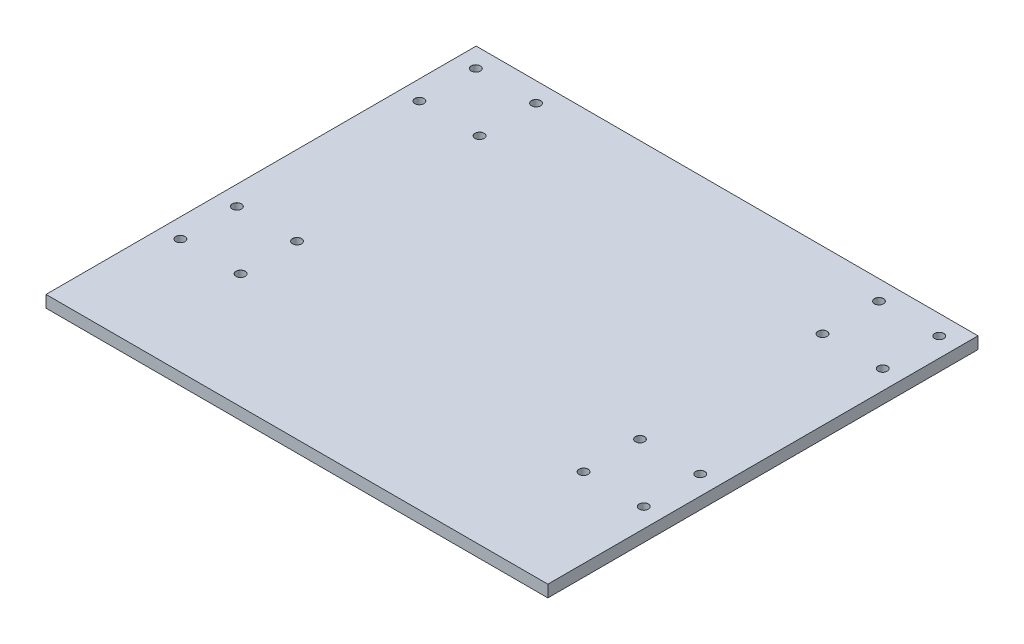
ISO-10303-21;
HEADER;
FILE_DESCRIPTION(('STEP AP214'),'2;1');
FILE_NAME('part.step','',(''),(''),'','','');
FILE_SCHEMA(('AUTOMOTIVE_DESIGN { 1 0 10303 214 1 1 1 1 }'));
ENDSEC;
DATA;
#1=APPLICATION_CONTEXT('core data for automotive mechanical design processes');
#2=APPLICATION_PROTOCOL_DEFINITION('international standard','automotive_design',2000,#1);
#3=PRODUCT_CONTEXT('',#1,'mechanical');
#4=PRODUCT('Part','Part','',(#3));
#5=PRODUCT_RELATED_PRODUCT_CATEGORY('part','',(#4));
#6=PRODUCT_DEFINITION_FORMATION('','',#4);
#7=PRODUCT_DEFINITION_CONTEXT('part definition',#1,'design');
#8=PRODUCT_DEFINITION('design','',#6,#7);
#9=PRODUCT_DEFINITION_SHAPE('','',#8);
#10=(LENGTH_UNIT() NAMED_UNIT(*) SI_UNIT(.MILLI.,.METRE.));
#11=(NAMED_UNIT(*) PLANE_ANGLE_UNIT() SI_UNIT($,.RADIAN.));
#12=(NAMED_UNIT(*) SI_UNIT($,.STERADIAN.) SOLID_ANGLE_UNIT());
#13=UNCERTAINTY_MEASURE_WITH_UNIT(LENGTH_MEASURE(1.E-05),#10,'distance_accuracy_value','');
#14=(GEOMETRIC_REPRESENTATION_CONTEXT(3) GLOBAL_UNCERTAINTY_ASSIGNED_CONTEXT((#13)) GLOBAL_UNIT_ASSIGNED_CONTEXT((#10,
#11,#12)) REPRESENTATION_CONTEXT('',''));
#15=CARTESIAN_POINT('',(0.,0.,0.));
#16=DIRECTION('',(0.,0.,1.));
#17=DIRECTION('',(1.,0.,0.));
#18=AXIS2_PLACEMENT_3D('',#15,#16,#17);
#19=CARTESIAN_POINT('',(133.35,6.35,-114.3));
#20=DIRECTION('',(-1.,0.,0.));
#21=DIRECTION('',(0.,0.,1.));
#22=AXIS2_PLACEMENT_3D('',#19,#20,#21);
#23=PLANE('',#22);
#24=DIRECTION('',(0.,0.,-1.));
#25=VECTOR('',#24,1.);
#26=CARTESIAN_POINT('',(133.35,0.,-114.3));
#27=LINE('',#26,#25);
#28=CARTESIAN_POINT('',(133.35,0.,114.3));
#29=VERTEX_POINT('',#28);
#30=CARTESIAN_POINT('',(133.35,0.,-114.3));
#31=VERTEX_POINT('',#30);
#32=EDGE_CURVE('E96',#29,#31,#27,.T.);
#33=ORIENTED_EDGE('',*,*,#32,.T.);
#34=DIRECTION('',(0.,-1.,0.));
#35=VECTOR('',#34,1.);
#36=CARTESIAN_POINT('',(133.35,6.35,-114.3));
#37=LINE('',#36,#35);
#38=CARTESIAN_POINT('',(133.35,6.35,-114.3));
#39=VERTEX_POINT('',#38);
#40=EDGE_CURVE('E11',#39,#31,#37,.T.);
#41=ORIENTED_EDGE('',*,*,#40,.F.);
#42=DIRECTION('',(0.,0.,-1.));
#43=VECTOR('',#42,1.);
#44=CARTESIAN_POINT('',(133.35,6.35,-114.3));
#45=LINE('',#44,#43);
#46=CARTESIAN_POINT('',(133.35,6.35,114.3));
#47=VERTEX_POINT('',#46);
#48=EDGE_CURVE('E84',#47,#39,#45,.T.);
#49=ORIENTED_EDGE('',*,*,#48,.F.);
#50=DIRECTION('',(0.,-1.,0.));
#51=VECTOR('',#50,1.);
#52=CARTESIAN_POINT('',(133.35,6.35,114.3));
#53=LINE('',#52,#51);
#54=EDGE_CURVE('E92',#47,#29,#53,.T.);
#55=ORIENTED_EDGE('',*,*,#54,.T.);
#56=EDGE_LOOP('',(#33,#41,#49,#55));
#57=FACE_BOUND('',#56,.T.);
#58=ADVANCED_FACE('F33',(#57),#23,.F.);
#59=CARTESIAN_POINT('',(-133.35,6.35,-114.3));
#60=DIRECTION('',(0.,0.,1.));
#61=DIRECTION('',(1.,0.,0.));
#62=AXIS2_PLACEMENT_3D('',#59,#60,#61);
#63=PLANE('',#62);
#64=DIRECTION('',(-1.,0.,0.));
#65=VECTOR('',#64,1.);
#66=CARTESIAN_POINT('',(-133.35,0.,-114.3));
#67=LINE('',#66,#65);
#68=CARTESIAN_POINT('',(-133.35,0.,-114.3));
#69=VERTEX_POINT('',#68);
#70=EDGE_CURVE('E88',#31,#69,#67,.T.);
#71=ORIENTED_EDGE('',*,*,#70,.T.);
#72=DIRECTION('',(0.,-1.,0.));
#73=VECTOR('',#72,1.);
#74=CARTESIAN_POINT('',(-133.35,6.35,-114.3));
#75=LINE('',#74,#73);
#76=CARTESIAN_POINT('',(-133.35,6.35,-114.3));
#77=VERTEX_POINT('',#76);
#78=EDGE_CURVE('E41',#77,#69,#75,.T.);
#79=ORIENTED_EDGE('',*,*,#78,.F.);
#80=DIRECTION('',(-1.,0.,0.));
#81=VECTOR('',#80,1.);
#82=CARTESIAN_POINT('',(-133.35,6.35,-114.3));
#83=LINE('',#82,#81);
#84=EDGE_CURVE('E79',#39,#77,#83,.T.);
#85=ORIENTED_EDGE('',*,*,#84,.F.);
#86=ORIENTED_EDGE('',*,*,#40,.T.);
#87=EDGE_LOOP('',(#71,#79,#85,#86));
#88=FACE_BOUND('',#87,.T.);
#89=ADVANCED_FACE('F87',(#88),#63,.F.);
#90=CARTESIAN_POINT('',(-133.35,6.35,-114.3));
#91=DIRECTION('',(1.,0.,0.));
#92=DIRECTION('',(0.,0.,-1.));
#93=AXIS2_PLACEMENT_3D('',#90,#91,#92);
#94=PLANE('',#93);
#95=DIRECTION('',(0.,0.,1.));
#96=VECTOR('',#95,1.);
#97=CARTESIAN_POINT('',(-133.35,0.,-114.3));
#98=LINE('',#97,#96);
#99=CARTESIAN_POINT('',(-133.35,0.,114.3));
#100=VERTEX_POINT('',#99);
#101=EDGE_CURVE('E66',#69,#100,#98,.T.);
#102=ORIENTED_EDGE('',*,*,#101,.T.);
#103=DIRECTION('',(0.,-1.,0.));
#104=VECTOR('',#103,1.);
#105=CARTESIAN_POINT('',(-133.35,6.35,114.3));
#106=LINE('',#105,#104);
#107=CARTESIAN_POINT('',(-133.35,6.35,114.3));
#108=VERTEX_POINT('',#107);
#109=EDGE_CURVE('E89',#108,#100,#106,.T.);
#110=ORIENTED_EDGE('',*,*,#109,.F.);
#111=DIRECTION('',(0.,0.,1.));
#112=VECTOR('',#111,1.);
#113=CARTESIAN_POINT('',(-133.35,6.35,-114.3));
#114=LINE('',#113,#112);
#115=EDGE_CURVE('E82',#77,#108,#114,.T.);
#116=ORIENTED_EDGE('',*,*,#115,.F.);
#117=ORIENTED_EDGE('',*,*,#78,.T.);
#118=EDGE_LOOP('',(#102,#110,#116,#117));
#119=FACE_BOUND('',#118,.T.);
#120=ADVANCED_FACE('F90',(#119),#94,.F.);
#121=CARTESIAN_POINT('',(-133.35,6.35,114.3));
#122=DIRECTION('',(0.,0.,-1.));
#123=DIRECTION('',(-1.,0.,0.));
#124=AXIS2_PLACEMENT_3D('',#121,#122,#123);
#125=PLANE('',#124);
#126=DIRECTION('',(1.,0.,0.));
#127=VECTOR('',#126,1.);
#128=CARTESIAN_POINT('',(-133.35,0.,114.3));
#129=LINE('',#128,#127);
#130=EDGE_CURVE('E72',#100,#29,#129,.T.);
#131=ORIENTED_EDGE('',*,*,#130,.T.);
#132=ORIENTED_EDGE('',*,*,#54,.F.);
#133=DIRECTION('',(1.,0.,0.));
#134=VECTOR('',#133,1.);
#135=CARTESIAN_POINT('',(-133.35,6.35,114.3));
#136=LINE('',#135,#134);
#137=EDGE_CURVE('E49',#108,#47,#136,.T.);
#138=ORIENTED_EDGE('',*,*,#137,.F.);
#139=ORIENTED_EDGE('',*,*,#109,.T.);
#140=EDGE_LOOP('',(#131,#132,#138,#139));
#141=FACE_BOUND('',#140,.T.);
#142=ADVANCED_FACE('F104',(#141),#125,.F.);
#143=CARTESIAN_POINT('',(0.,6.35,0.));
#144=DIRECTION('',(0.,1.,0.));
#145=DIRECTION('',(0.,0.,1.));
#146=AXIS2_PLACEMENT_3D('',#143,#144,#145);
#147=PLANE('',#146);
#148=CARTESIAN_POINT('',(123.125,6.35,-103.9));
#149=DIRECTION('',(0.,1.,0.));
#150=DIRECTION('',(0.,0.,1.));
#151=AXIS2_PLACEMENT_3D('',#148,#149,#150);
#152=CIRCLE('',#151,2.425);
#153=CARTESIAN_POINT('',(123.125,6.35,-101.475));
#154=VERTEX_POINT('',#153);
#155=EDGE_CURVE('E250',#154,#154,#152,.T.);
#156=ORIENTED_EDGE('',*,*,#155,.F.);
#157=EDGE_LOOP('',(#156));
#158=FACE_BOUND('',#157,.T.);
#159=CARTESIAN_POINT('',(91.1249999999999,6.35,-103.9));
#160=DIRECTION('',(0.,1.,0.));
#161=DIRECTION('',(0.,0.,1.));
#162=AXIS2_PLACEMENT_3D('',#159,#160,#161);
#163=CIRCLE('',#162,2.425);
#164=CARTESIAN_POINT('',(91.1249999999999,6.35,-101.475));
#165=VERTEX_POINT('',#164);
#166=EDGE_CURVE('E241',#165,#165,#163,.T.);
#167=ORIENTED_EDGE('',*,*,#166,.F.);
#168=EDGE_LOOP('',(#167));
#169=FACE_BOUND('',#168,.T.);
#170=CARTESIAN_POINT('',(91.1249999999999,6.35,-73.9));
#171=DIRECTION('',(0.,1.,0.));
#172=DIRECTION('',(0.,0.,1.));
#173=AXIS2_PLACEMENT_3D('',#170,#171,#172);
#174=CIRCLE('',#173,2.425);
#175=CARTESIAN_POINT('',(91.1249999999999,6.35,-71.475));
#176=VERTEX_POINT('',#175);
#177=EDGE_CURVE('E232',#176,#176,#174,.T.);
#178=ORIENTED_EDGE('',*,*,#177,.F.);
#179=EDGE_LOOP('',(#178));
#180=FACE_BOUND('',#179,.T.);
#181=CARTESIAN_POINT('',(123.125,6.35,53.0999999999999));
#182=DIRECTION('',(0.,1.,0.));
#183=DIRECTION('',(0.,0.,1.));
#184=AXIS2_PLACEMENT_3D('',#181,#182,#183);
#185=CIRCLE('',#184,2.425);
#186=CARTESIAN_POINT('',(123.125,6.35,55.5249999999999));
#187=VERTEX_POINT('',#186);
#188=EDGE_CURVE('E223',#187,#187,#185,.T.);
#189=ORIENTED_EDGE('',*,*,#188,.F.);
#190=EDGE_LOOP('',(#189));
#191=FACE_BOUND('',#190,.T.);
#192=CARTESIAN_POINT('',(123.125,6.35,23.0999999999999));
#193=DIRECTION('',(0.,1.,0.));
#194=DIRECTION('',(0.,0.,1.));
#195=AXIS2_PLACEMENT_3D('',#192,#193,#194);
#196=CIRCLE('',#195,2.425);
#197=CARTESIAN_POINT('',(123.125,6.35,25.5249999999999));
#198=VERTEX_POINT('',#197);
#199=EDGE_CURVE('E214',#198,#198,#196,.T.);
#200=ORIENTED_EDGE('',*,*,#199,.F.);
#201=EDGE_LOOP('',(#200));
#202=FACE_BOUND('',#201,.T.);
#203=CARTESIAN_POINT('',(123.125,6.35,-73.9));
#204=DIRECTION('',(0.,1.,0.));
#205=DIRECTION('',(0.,0.,1.));
#206=AXIS2_PLACEMENT_3D('',#203,#204,#205);
#207=CIRCLE('',#206,2.425);
#208=CARTESIAN_POINT('',(123.125,6.35,-71.475));
#209=VERTEX_POINT('',#208);
#210=EDGE_CURVE('E205',#209,#209,#207,.T.);
#211=ORIENTED_EDGE('',*,*,#210,.F.);
#212=EDGE_LOOP('',(#211));
#213=FACE_BOUND('',#212,.T.);
#214=CARTESIAN_POINT('',(-123.125,6.35,-103.9));
#215=DIRECTION('',(0.,1.,0.));
#216=DIRECTION('',(0.,0.,1.));
#217=AXIS2_PLACEMENT_3D('',#214,#215,#216);
#218=CIRCLE('',#217,2.425);
#219=CARTESIAN_POINT('',(-123.125,6.35,-101.475));
#220=VERTEX_POINT('',#219);
#221=EDGE_CURVE('E196',#220,#220,#218,.T.);
#222=ORIENTED_EDGE('',*,*,#221,.F.);
#223=EDGE_LOOP('',(#222));
#224=FACE_BOUND('',#223,.T.);
#225=CARTESIAN_POINT('',(-91.1250000000001,6.35,-103.9));
#226=DIRECTION('',(0.,1.,0.));
#227=DIRECTION('',(0.,0.,1.));
#228=AXIS2_PLACEMENT_3D('',#225,#226,#227);
#229=CIRCLE('',#228,2.425);
#230=CARTESIAN_POINT('',(-91.1250000000001,6.35,-101.475));
#231=VERTEX_POINT('',#230);
#232=EDGE_CURVE('E187',#231,#231,#229,.T.);
#233=ORIENTED_EDGE('',*,*,#232,.F.);
#234=EDGE_LOOP('',(#233));
#235=FACE_BOUND('',#234,.T.);
#236=CARTESIAN_POINT('',(-91.1250000000001,6.35,-73.8999999999999));
#237=DIRECTION('',(0.,1.,0.));
#238=DIRECTION('',(0.,0.,1.));
#239=AXIS2_PLACEMENT_3D('',#236,#237,#238);
#240=CIRCLE('',#239,2.425);
#241=CARTESIAN_POINT('',(-91.1250000000001,6.35,-71.4749999999999));
#242=VERTEX_POINT('',#241);
#243=EDGE_CURVE('E178',#242,#242,#240,.T.);
#244=ORIENTED_EDGE('',*,*,#243,.F.);
#245=EDGE_LOOP('',(#244));
#246=FACE_BOUND('',#245,.T.);
#247=CARTESIAN_POINT('',(91.125,6.35,53.0999999999999));
#248=DIRECTION('',(0.,1.,0.));
#249=DIRECTION('',(0.,0.,1.));
#250=AXIS2_PLACEMENT_3D('',#247,#248,#249);
#251=CIRCLE('',#250,2.425);
#252=CARTESIAN_POINT('',(91.125,6.35,55.5249999999999));
#253=VERTEX_POINT('',#252);
#254=EDGE_CURVE('E169',#253,#253,#251,.T.);
#255=ORIENTED_EDGE('',*,*,#254,.F.);
#256=EDGE_LOOP('',(#255));
#257=FACE_BOUND('',#256,.T.);
#258=CARTESIAN_POINT('',(-123.125,6.35,53.1000000000001));
#259=DIRECTION('',(0.,1.,0.));
#260=DIRECTION('',(0.,0.,1.));
#261=AXIS2_PLACEMENT_3D('',#258,#259,#260);
#262=CIRCLE('',#261,2.425);
#263=CARTESIAN_POINT('',(-123.125,6.35,55.5250000000001));
#264=VERTEX_POINT('',#263);
#265=EDGE_CURVE('E160',#264,#264,#262,.T.);
#266=ORIENTED_EDGE('',*,*,#265,.F.);
#267=EDGE_LOOP('',(#266));
#268=FACE_BOUND('',#267,.T.);
#269=CARTESIAN_POINT('',(-91.125,6.35,53.1000000000001));
#270=DIRECTION('',(0.,1.,0.));
#271=DIRECTION('',(0.,0.,1.));
#272=AXIS2_PLACEMENT_3D('',#269,#270,#271);
#273=CIRCLE('',#272,2.425);
#274=CARTESIAN_POINT('',(-91.125,6.35,55.5250000000001));
#275=VERTEX_POINT('',#274);
#276=EDGE_CURVE('E151',#275,#275,#273,.T.);
#277=ORIENTED_EDGE('',*,*,#276,.F.);
#278=EDGE_LOOP('',(#277));
#279=FACE_BOUND('',#278,.T.);
#280=CARTESIAN_POINT('',(-91.125,6.35,23.1000000000001));
#281=DIRECTION('',(0.,1.,0.));
#282=DIRECTION('',(0.,0.,1.));
#283=AXIS2_PLACEMENT_3D('',#280,#281,#282);
#284=CIRCLE('',#283,2.425);
#285=CARTESIAN_POINT('',(-91.125,6.35,25.5250000000001));
#286=VERTEX_POINT('',#285);
#287=EDGE_CURVE('E142',#286,#286,#284,.T.);
#288=ORIENTED_EDGE('',*,*,#287,.F.);
#289=EDGE_LOOP('',(#288));
#290=FACE_BOUND('',#289,.T.);
#291=CARTESIAN_POINT('',(-123.125,6.35,23.1000000000001));
#292=DIRECTION('',(0.,1.,0.));
#293=DIRECTION('',(0.,0.,1.));
#294=AXIS2_PLACEMENT_3D('',#291,#292,#293);
#295=CIRCLE('',#294,2.425);
#296=CARTESIAN_POINT('',(-123.125,6.35,25.5250000000001));
#297=VERTEX_POINT('',#296);
#298=EDGE_CURVE('E133',#297,#297,#295,.T.);
#299=ORIENTED_EDGE('',*,*,#298,.F.);
#300=EDGE_LOOP('',(#299));
#301=FACE_BOUND('',#300,.T.);
#302=CARTESIAN_POINT('',(-123.125,6.35,-73.8999999999999));
#303=DIRECTION('',(0.,1.,0.));
#304=DIRECTION('',(0.,0.,1.));
#305=AXIS2_PLACEMENT_3D('',#302,#303,#304);
#306=CIRCLE('',#305,2.425);
#307=CARTESIAN_POINT('',(-123.125,6.35,-71.4749999999999));
#308=VERTEX_POINT('',#307);
#309=EDGE_CURVE('E124',#308,#308,#306,.T.);
#310=ORIENTED_EDGE('',*,*,#309,.F.);
#311=EDGE_LOOP('',(#310));
#312=FACE_BOUND('',#311,.T.);
#313=CARTESIAN_POINT('',(91.125,6.35,23.0999999999999));
#314=DIRECTION('',(0.,1.,0.));
#315=DIRECTION('',(0.,0.,1.));
#316=AXIS2_PLACEMENT_3D('',#313,#314,#315);
#317=CIRCLE('',#316,2.425);
#318=CARTESIAN_POINT('',(91.125,6.35,25.5249999999999));
#319=VERTEX_POINT('',#318);
#320=EDGE_CURVE('E115',#319,#319,#317,.T.);
#321=ORIENTED_EDGE('',*,*,#320,.F.);
#322=EDGE_LOOP('',(#321));
#323=FACE_BOUND('',#322,.T.);
#324=ORIENTED_EDGE('',*,*,#48,.T.);
#325=ORIENTED_EDGE('',*,*,#84,.T.);
#326=ORIENTED_EDGE('',*,*,#115,.T.);
#327=ORIENTED_EDGE('',*,*,#137,.T.);
#328=EDGE_LOOP('',(#324,#325,#326,#327));
#329=FACE_BOUND('',#328,.T.);
#330=ADVANCED_FACE('F80',(#158,#169,#180,#191,#202,#213,#224,#235,#246,#257,#268,#279,#290,#301,
#312,#323,#329),#147,.T.);
#331=CARTESIAN_POINT('',(0.,0.,0.));
#332=DIRECTION('',(0.,1.,0.));
#333=DIRECTION('',(0.,0.,1.));
#334=AXIS2_PLACEMENT_3D('',#331,#332,#333);
#335=PLANE('',#334);
#336=CARTESIAN_POINT('',(123.125,0.,-103.9));
#337=DIRECTION('',(0.,1.,0.));
#338=DIRECTION('',(0.,0.,1.));
#339=AXIS2_PLACEMENT_3D('',#336,#337,#338);
#340=CIRCLE('',#339,2.4);
#341=CARTESIAN_POINT('',(123.125,0.,-101.5));
#342=VERTEX_POINT('',#341);
#343=EDGE_CURVE('E244',#342,#342,#340,.T.);
#344=ORIENTED_EDGE('',*,*,#343,.T.);
#345=EDGE_LOOP('',(#344));
#346=FACE_BOUND('',#345,.T.);
#347=CARTESIAN_POINT('',(91.1249999999999,0.,-103.9));
#348=DIRECTION('',(0.,1.,0.));
#349=DIRECTION('',(0.,0.,1.));
#350=AXIS2_PLACEMENT_3D('',#347,#348,#349);
#351=CIRCLE('',#350,2.4);
#352=CARTESIAN_POINT('',(91.1249999999999,0.,-101.5));
#353=VERTEX_POINT('',#352);
#354=EDGE_CURVE('E235',#353,#353,#351,.T.);
#355=ORIENTED_EDGE('',*,*,#354,.T.);
#356=EDGE_LOOP('',(#355));
#357=FACE_BOUND('',#356,.T.);
#358=CARTESIAN_POINT('',(91.1249999999999,0.,-73.9));
#359=DIRECTION('',(0.,1.,0.));
#360=DIRECTION('',(0.,0.,1.));
#361=AXIS2_PLACEMENT_3D('',#358,#359,#360);
#362=CIRCLE('',#361,2.4);
#363=CARTESIAN_POINT('',(91.1249999999999,0.,-71.5));
#364=VERTEX_POINT('',#363);
#365=EDGE_CURVE('E226',#364,#364,#362,.T.);
#366=ORIENTED_EDGE('',*,*,#365,.T.);
#367=EDGE_LOOP('',(#366));
#368=FACE_BOUND('',#367,.T.);
#369=CARTESIAN_POINT('',(123.125,0.,53.0999999999999));
#370=DIRECTION('',(0.,1.,0.));
#371=DIRECTION('',(0.,0.,1.));
#372=AXIS2_PLACEMENT_3D('',#369,#370,#371);
#373=CIRCLE('',#372,2.4);
#374=CARTESIAN_POINT('',(123.125,0.,55.4999999999999));
#375=VERTEX_POINT('',#374);
#376=EDGE_CURVE('E217',#375,#375,#373,.T.);
#377=ORIENTED_EDGE('',*,*,#376,.T.);
#378=EDGE_LOOP('',(#377));
#379=FACE_BOUND('',#378,.T.);
#380=CARTESIAN_POINT('',(123.125,0.,23.0999999999999));
#381=DIRECTION('',(0.,1.,0.));
#382=DIRECTION('',(0.,0.,1.));
#383=AXIS2_PLACEMENT_3D('',#380,#381,#382);
#384=CIRCLE('',#383,2.4);
#385=CARTESIAN_POINT('',(123.125,0.,25.4999999999999));
#386=VERTEX_POINT('',#385);
#387=EDGE_CURVE('E208',#386,#386,#384,.T.);
#388=ORIENTED_EDGE('',*,*,#387,.T.);
#389=EDGE_LOOP('',(#388));
#390=FACE_BOUND('',#389,.T.);
#391=CARTESIAN_POINT('',(123.125,0.,-73.9));
#392=DIRECTION('',(0.,1.,0.));
#393=DIRECTION('',(0.,0.,1.));
#394=AXIS2_PLACEMENT_3D('',#391,#392,#393);
#395=CIRCLE('',#394,2.4);
#396=CARTESIAN_POINT('',(123.125,0.,-71.5));
#397=VERTEX_POINT('',#396);
#398=EDGE_CURVE('E199',#397,#397,#395,.T.);
#399=ORIENTED_EDGE('',*,*,#398,.T.);
#400=EDGE_LOOP('',(#399));
#401=FACE_BOUND('',#400,.T.);
#402=CARTESIAN_POINT('',(-123.125,0.,-103.9));
#403=DIRECTION('',(0.,1.,0.));
#404=DIRECTION('',(0.,0.,1.));
#405=AXIS2_PLACEMENT_3D('',#402,#403,#404);
#406=CIRCLE('',#405,2.4);
#407=CARTESIAN_POINT('',(-123.125,0.,-101.5));
#408=VERTEX_POINT('',#407);
#409=EDGE_CURVE('E190',#408,#408,#406,.T.);
#410=ORIENTED_EDGE('',*,*,#409,.T.);
#411=EDGE_LOOP('',(#410));
#412=FACE_BOUND('',#411,.T.);
#413=CARTESIAN_POINT('',(-91.1250000000001,0.,-103.9));
#414=DIRECTION('',(0.,1.,0.));
#415=DIRECTION('',(0.,0.,1.));
#416=AXIS2_PLACEMENT_3D('',#413,#414,#415);
#417=CIRCLE('',#416,2.4);
#418=CARTESIAN_POINT('',(-91.1250000000001,0.,-101.5));
#419=VERTEX_POINT('',#418);
#420=EDGE_CURVE('E181',#419,#419,#417,.T.);
#421=ORIENTED_EDGE('',*,*,#420,.T.);
#422=EDGE_LOOP('',(#421));
#423=FACE_BOUND('',#422,.T.);
#424=CARTESIAN_POINT('',(-91.1250000000001,0.,-73.8999999999999));
#425=DIRECTION('',(0.,1.,0.));
#426=DIRECTION('',(0.,0.,1.));
#427=AXIS2_PLACEMENT_3D('',#424,#425,#426);
#428=CIRCLE('',#427,2.4);
#429=CARTESIAN_POINT('',(-91.1250000000001,0.,-71.4999999999999));
#430=VERTEX_POINT('',#429);
#431=EDGE_CURVE('E172',#430,#430,#428,.T.);
#432=ORIENTED_EDGE('',*,*,#431,.T.);
#433=EDGE_LOOP('',(#432));
#434=FACE_BOUND('',#433,.T.);
#435=CARTESIAN_POINT('',(91.125,0.,53.0999999999999));
#436=DIRECTION('',(0.,1.,0.));
#437=DIRECTION('',(0.,0.,1.));
#438=AXIS2_PLACEMENT_3D('',#435,#436,#437);
#439=CIRCLE('',#438,2.4);
#440=CARTESIAN_POINT('',(91.125,0.,55.4999999999999));
#441=VERTEX_POINT('',#440);
#442=EDGE_CURVE('E163',#441,#441,#439,.T.);
#443=ORIENTED_EDGE('',*,*,#442,.T.);
#444=EDGE_LOOP('',(#443));
#445=FACE_BOUND('',#444,.T.);
#446=CARTESIAN_POINT('',(-123.125,0.,53.1000000000001));
#447=DIRECTION('',(0.,1.,0.));
#448=DIRECTION('',(0.,0.,1.));
#449=AXIS2_PLACEMENT_3D('',#446,#447,#448);
#450=CIRCLE('',#449,2.4);
#451=CARTESIAN_POINT('',(-123.125,0.,55.5000000000001));
#452=VERTEX_POINT('',#451);
#453=EDGE_CURVE('E154',#452,#452,#450,.T.);
#454=ORIENTED_EDGE('',*,*,#453,.T.);
#455=EDGE_LOOP('',(#454));
#456=FACE_BOUND('',#455,.T.);
#457=CARTESIAN_POINT('',(-91.125,0.,53.1000000000001));
#458=DIRECTION('',(0.,1.,0.));
#459=DIRECTION('',(0.,0.,1.));
#460=AXIS2_PLACEMENT_3D('',#457,#458,#459);
#461=CIRCLE('',#460,2.4);
#462=CARTESIAN_POINT('',(-91.125,0.,55.5000000000001));
#463=VERTEX_POINT('',#462);
#464=EDGE_CURVE('E145',#463,#463,#461,.T.);
#465=ORIENTED_EDGE('',*,*,#464,.T.);
#466=EDGE_LOOP('',(#465));
#467=FACE_BOUND('',#466,.T.);
#468=CARTESIAN_POINT('',(-91.125,0.,23.1000000000001));
#469=DIRECTION('',(0.,1.,0.));
#470=DIRECTION('',(0.,0.,1.));
#471=AXIS2_PLACEMENT_3D('',#468,#469,#470);
#472=CIRCLE('',#471,2.4);
#473=CARTESIAN_POINT('',(-91.125,0.,25.5000000000001));
#474=VERTEX_POINT('',#473);
#475=EDGE_CURVE('E136',#474,#474,#472,.T.);
#476=ORIENTED_EDGE('',*,*,#475,.T.);
#477=EDGE_LOOP('',(#476));
#478=FACE_BOUND('',#477,.T.);
#479=CARTESIAN_POINT('',(-123.125,0.,23.1000000000001));
#480=DIRECTION('',(0.,1.,0.));
#481=DIRECTION('',(0.,0.,1.));
#482=AXIS2_PLACEMENT_3D('',#479,#480,#481);
#483=CIRCLE('',#482,2.4);
#484=CARTESIAN_POINT('',(-123.125,0.,25.5000000000001));
#485=VERTEX_POINT('',#484);
#486=EDGE_CURVE('E127',#485,#485,#483,.T.);
#487=ORIENTED_EDGE('',*,*,#486,.T.);
#488=EDGE_LOOP('',(#487));
#489=FACE_BOUND('',#488,.T.);
#490=CARTESIAN_POINT('',(-123.125,0.,-73.8999999999999));
#491=DIRECTION('',(0.,1.,0.));
#492=DIRECTION('',(0.,0.,1.));
#493=AXIS2_PLACEMENT_3D('',#490,#491,#492);
#494=CIRCLE('',#493,2.4);
#495=CARTESIAN_POINT('',(-123.125,0.,-71.4999999999999));
#496=VERTEX_POINT('',#495);
#497=EDGE_CURVE('E118',#496,#496,#494,.T.);
#498=ORIENTED_EDGE('',*,*,#497,.T.);
#499=EDGE_LOOP('',(#498));
#500=FACE_BOUND('',#499,.T.);
#501=CARTESIAN_POINT('',(91.125,0.,23.0999999999999));
#502=DIRECTION('',(0.,1.,0.));
#503=DIRECTION('',(0.,0.,1.));
#504=AXIS2_PLACEMENT_3D('',#501,#502,#503);
#505=CIRCLE('',#504,2.4);
#506=CARTESIAN_POINT('',(91.125,0.,25.4999999999999));
#507=VERTEX_POINT('',#506);
#508=EDGE_CURVE('E99',#507,#507,#505,.T.);
#509=ORIENTED_EDGE('',*,*,#508,.T.);
#510=EDGE_LOOP('',(#509));
#511=FACE_BOUND('',#510,.T.);
#512=ORIENTED_EDGE('',*,*,#32,.F.);
#513=ORIENTED_EDGE('',*,*,#130,.F.);
#514=ORIENTED_EDGE('',*,*,#101,.F.);
#515=ORIENTED_EDGE('',*,*,#70,.F.);
#516=EDGE_LOOP('',(#512,#513,#514,#515));
#517=FACE_BOUND('',#516,.T.);
#518=ADVANCED_FACE('F107',(#346,#357,#368,#379,#390,#401,#412,#423,#434,#445,#456,#467,#478,
#489,#500,#511,#517),#335,.F.);
#519=CARTESIAN_POINT('',(91.125,6.35,23.0999999999999));
#520=DIRECTION('',(0.,1.,0.));
#521=DIRECTION('',(0.,0.,1.));
#522=AXIS2_PLACEMENT_3D('',#519,#520,#521);
#523=CYLINDRICAL_SURFACE('',#522,2.4);
#524=ORIENTED_EDGE('',*,*,#508,.F.);
#525=EDGE_LOOP('',(#524));
#526=FACE_BOUND('',#525,.T.);
#527=CARTESIAN_POINT('',(91.125,6.325,23.0999999999999));
#528=DIRECTION('',(0.,1.,0.));
#529=DIRECTION('',(0.,0.,1.));
#530=AXIS2_PLACEMENT_3D('',#527,#528,#529);
#531=CIRCLE('',#530,2.4);
#532=CARTESIAN_POINT('',(91.125,6.325,25.4999999999999));
#533=VERTEX_POINT('',#532);
#534=EDGE_CURVE('E112',#533,#533,#531,.T.);
#535=ORIENTED_EDGE('',*,*,#534,.T.);
#536=EDGE_LOOP('',(#535));
#537=FACE_BOUND('',#536,.T.);
#538=ADVANCED_FACE('F292',(#526,#537),#523,.F.);
#539=CARTESIAN_POINT('',(91.125,6.35,23.0999999999999));
#540=DIRECTION('',(0.,1.,0.));
#541=DIRECTION('',(0.,0.,1.));
#542=AXIS2_PLACEMENT_3D('',#539,#540,#541);
#543=CONICAL_SURFACE('',#542,2.425,0.785398163397344);
#544=ORIENTED_EDGE('',*,*,#534,.F.);
#545=EDGE_LOOP('',(#544));
#546=FACE_BOUND('',#545,.T.);
#547=ORIENTED_EDGE('',*,*,#320,.T.);
#548=EDGE_LOOP('',(#547));
#549=FACE_BOUND('',#548,.T.);
#550=ADVANCED_FACE('F289',(#546,#549),#543,.F.);
#551=CARTESIAN_POINT('',(-123.125,6.35,-73.8999999999999));
#552=DIRECTION('',(0.,1.,0.));
#553=DIRECTION('',(0.,0.,1.));
#554=AXIS2_PLACEMENT_3D('',#551,#552,#553);
#555=CYLINDRICAL_SURFACE('',#554,2.4);
#556=ORIENTED_EDGE('',*,*,#497,.F.);
#557=EDGE_LOOP('',(#556));
#558=FACE_BOUND('',#557,.T.);
#559=CARTESIAN_POINT('',(-123.125,6.325,-73.8999999999999));
#560=DIRECTION('',(0.,1.,0.));
#561=DIRECTION('',(0.,0.,1.));
#562=AXIS2_PLACEMENT_3D('',#559,#560,#561);
#563=CIRCLE('',#562,2.4);
#564=CARTESIAN_POINT('',(-123.125,6.325,-71.4999999999999));
#565=VERTEX_POINT('',#564);
#566=EDGE_CURVE('E121',#565,#565,#563,.T.);
#567=ORIENTED_EDGE('',*,*,#566,.T.);
#568=EDGE_LOOP('',(#567));
#569=FACE_BOUND('',#568,.T.);
#570=ADVANCED_FACE('F291',(#558,#569),#555,.F.);
#571=CARTESIAN_POINT('',(-123.125,6.35,-73.8999999999999));
#572=DIRECTION('',(0.,1.,0.));
#573=DIRECTION('',(0.,0.,1.));
#574=AXIS2_PLACEMENT_3D('',#571,#572,#573);
#575=CONICAL_SURFACE('',#574,2.425,0.785398163397344);
#576=ORIENTED_EDGE('',*,*,#566,.F.);
#577=EDGE_LOOP('',(#576));
#578=FACE_BOUND('',#577,.T.);
#579=ORIENTED_EDGE('',*,*,#309,.T.);
#580=EDGE_LOOP('',(#579));
#581=FACE_BOUND('',#580,.T.);
#582=ADVANCED_FACE('F299',(#578,#581),#575,.F.);
#583=CARTESIAN_POINT('',(-123.125,6.35,23.1000000000001));
#584=DIRECTION('',(0.,1.,0.));
#585=DIRECTION('',(0.,0.,1.));
#586=AXIS2_PLACEMENT_3D('',#583,#584,#585);
#587=CYLINDRICAL_SURFACE('',#586,2.4);
#588=ORIENTED_EDGE('',*,*,#486,.F.);
#589=EDGE_LOOP('',(#588));
#590=FACE_BOUND('',#589,.T.);
#591=CARTESIAN_POINT('',(-123.125,6.325,23.1000000000001));
#592=DIRECTION('',(0.,1.,0.));
#593=DIRECTION('',(0.,0.,1.));
#594=AXIS2_PLACEMENT_3D('',#591,#592,#593);
#595=CIRCLE('',#594,2.4);
#596=CARTESIAN_POINT('',(-123.125,6.325,25.5000000000001));
#597=VERTEX_POINT('',#596);
#598=EDGE_CURVE('E130',#597,#597,#595,.T.);
#599=ORIENTED_EDGE('',*,*,#598,.T.);
#600=EDGE_LOOP('',(#599));
#601=FACE_BOUND('',#600,.T.);
#602=ADVANCED_FACE('F357',(#590,#601),#587,.F.);
#603=CARTESIAN_POINT('',(-123.125,6.35,23.1000000000001));
#604=DIRECTION('',(0.,1.,0.));
#605=DIRECTION('',(0.,0.,1.));
#606=AXIS2_PLACEMENT_3D('',#603,#604,#605);
#607=CONICAL_SURFACE('',#606,2.425,0.785398163397344);
#608=ORIENTED_EDGE('',*,*,#598,.F.);
#609=EDGE_LOOP('',(#608));
#610=FACE_BOUND('',#609,.T.);
#611=ORIENTED_EDGE('',*,*,#298,.T.);
#612=EDGE_LOOP('',(#611));
#613=FACE_BOUND('',#612,.T.);
#614=ADVANCED_FACE('F362',(#610,#613),#607,.F.);
#615=CARTESIAN_POINT('',(-91.125,6.35,23.1000000000001));
#616=DIRECTION('',(0.,1.,0.));
#617=DIRECTION('',(0.,0.,1.));
#618=AXIS2_PLACEMENT_3D('',#615,#616,#617);
#619=CYLINDRICAL_SURFACE('',#618,2.4);
#620=ORIENTED_EDGE('',*,*,#475,.F.);
#621=EDGE_LOOP('',(#620));
#622=FACE_BOUND('',#621,.T.);
#623=CARTESIAN_POINT('',(-91.125,6.325,23.1000000000001));
#624=DIRECTION('',(0.,1.,0.));
#625=DIRECTION('',(0.,0.,1.));
#626=AXIS2_PLACEMENT_3D('',#623,#624,#625);
#627=CIRCLE('',#626,2.4);
#628=CARTESIAN_POINT('',(-91.125,6.325,25.5000000000001));
#629=VERTEX_POINT('',#628);
#630=EDGE_CURVE('E139',#629,#629,#627,.T.);
#631=ORIENTED_EDGE('',*,*,#630,.T.);
#632=EDGE_LOOP('',(#631));
#633=FACE_BOUND('',#632,.T.);
#634=ADVANCED_FACE('F368',(#622,#633),#619,.F.);
#635=CARTESIAN_POINT('',(-91.125,6.35,23.1000000000001));
#636=DIRECTION('',(0.,1.,0.));
#637=DIRECTION('',(0.,0.,1.));
#638=AXIS2_PLACEMENT_3D('',#635,#636,#637);
#639=CONICAL_SURFACE('',#638,2.425,0.785398163397344);
#640=ORIENTED_EDGE('',*,*,#630,.F.);
#641=EDGE_LOOP('',(#640));
#642=FACE_BOUND('',#641,.T.);
#643=ORIENTED_EDGE('',*,*,#287,.T.);
#644=EDGE_LOOP('',(#643));
#645=FACE_BOUND('',#644,.T.);
#646=ADVANCED_FACE('F372',(#642,#645),#639,.F.);
#647=CARTESIAN_POINT('',(-91.125,6.35,53.1000000000001));
#648=DIRECTION('',(0.,1.,0.));
#649=DIRECTION('',(0.,0.,1.));
#650=AXIS2_PLACEMENT_3D('',#647,#648,#649);
#651=CYLINDRICAL_SURFACE('',#650,2.4);
#652=ORIENTED_EDGE('',*,*,#464,.F.);
#653=EDGE_LOOP('',(#652));
#654=FACE_BOUND('',#653,.T.);
#655=CARTESIAN_POINT('',(-91.125,6.325,53.1000000000001));
#656=DIRECTION('',(0.,1.,0.));
#657=DIRECTION('',(0.,0.,1.));
#658=AXIS2_PLACEMENT_3D('',#655,#656,#657);
#659=CIRCLE('',#658,2.4);
#660=CARTESIAN_POINT('',(-91.125,6.325,55.5000000000001));
#661=VERTEX_POINT('',#660);
#662=EDGE_CURVE('E148',#661,#661,#659,.T.);
#663=ORIENTED_EDGE('',*,*,#662,.T.);
#664=EDGE_LOOP('',(#663));
#665=FACE_BOUND('',#664,.T.);
#666=ADVANCED_FACE('F376',(#654,#665),#651,.F.);
#667=CARTESIAN_POINT('',(-91.125,6.35,53.1000000000001));
#668=DIRECTION('',(0.,1.,0.));
#669=DIRECTION('',(0.,0.,1.));
#670=AXIS2_PLACEMENT_3D('',#667,#668,#669);
#671=CONICAL_SURFACE('',#670,2.425,0.785398163397344);
#672=ORIENTED_EDGE('',*,*,#662,.F.);
#673=EDGE_LOOP('',(#672));
#674=FACE_BOUND('',#673,.T.);
#675=ORIENTED_EDGE('',*,*,#276,.T.);
#676=EDGE_LOOP('',(#675));
#677=FACE_BOUND('',#676,.T.);
#678=ADVANCED_FACE('F380',(#674,#677),#671,.F.);
#679=CARTESIAN_POINT('',(-123.125,6.35,53.1000000000001));
#680=DIRECTION('',(0.,1.,0.));
#681=DIRECTION('',(0.,0.,1.));
#682=AXIS2_PLACEMENT_3D('',#679,#680,#681);
#683=CYLINDRICAL_SURFACE('',#682,2.4);
#684=ORIENTED_EDGE('',*,*,#453,.F.);
#685=EDGE_LOOP('',(#684));
#686=FACE_BOUND('',#685,.T.);
#687=CARTESIAN_POINT('',(-123.125,6.325,53.1000000000001));
#688=DIRECTION('',(0.,1.,0.));
#689=DIRECTION('',(0.,0.,1.));
#690=AXIS2_PLACEMENT_3D('',#687,#688,#689);
#691=CIRCLE('',#690,2.4);
#692=CARTESIAN_POINT('',(-123.125,6.325,55.5000000000001));
#693=VERTEX_POINT('',#692);
#694=EDGE_CURVE('E157',#693,#693,#691,.T.);
#695=ORIENTED_EDGE('',*,*,#694,.T.);
#696=EDGE_LOOP('',(#695));
#697=FACE_BOUND('',#696,.T.);
#698=ADVANCED_FACE('F384',(#686,#697),#683,.F.);
#699=CARTESIAN_POINT('',(-123.125,6.35,53.1000000000001));
#700=DIRECTION('',(0.,1.,0.));
#701=DIRECTION('',(0.,0.,1.));
#702=AXIS2_PLACEMENT_3D('',#699,#700,#701);
#703=CONICAL_SURFACE('',#702,2.425,0.785398163397344);
#704=ORIENTED_EDGE('',*,*,#694,.F.);
#705=EDGE_LOOP('',(#704));
#706=FACE_BOUND('',#705,.T.);
#707=ORIENTED_EDGE('',*,*,#265,.T.);
#708=EDGE_LOOP('',(#707));
#709=FACE_BOUND('',#708,.T.);
#710=ADVANCED_FACE('F388',(#706,#709),#703,.F.);
#711=CARTESIAN_POINT('',(91.125,6.35,53.0999999999999));
#712=DIRECTION('',(0.,1.,0.));
#713=DIRECTION('',(0.,0.,1.));
#714=AXIS2_PLACEMENT_3D('',#711,#712,#713);
#715=CYLINDRICAL_SURFACE('',#714,2.4);
#716=ORIENTED_EDGE('',*,*,#442,.F.);
#717=EDGE_LOOP('',(#716));
#718=FACE_BOUND('',#717,.T.);
#719=CARTESIAN_POINT('',(91.125,6.325,53.0999999999999));
#720=DIRECTION('',(0.,1.,0.));
#721=DIRECTION('',(0.,0.,1.));
#722=AXIS2_PLACEMENT_3D('',#719,#720,#721);
#723=CIRCLE('',#722,2.4);
#724=CARTESIAN_POINT('',(91.125,6.325,55.4999999999999));
#725=VERTEX_POINT('',#724);
#726=EDGE_CURVE('E166',#725,#725,#723,.T.);
#727=ORIENTED_EDGE('',*,*,#726,.T.);
#728=EDGE_LOOP('',(#727));
#729=FACE_BOUND('',#728,.T.);
#730=ADVANCED_FACE('F392',(#718,#729),#715,.F.);
#731=CARTESIAN_POINT('',(91.125,6.35,53.0999999999999));
#732=DIRECTION('',(0.,1.,0.));
#733=DIRECTION('',(0.,0.,1.));
#734=AXIS2_PLACEMENT_3D('',#731,#732,#733);
#735=CONICAL_SURFACE('',#734,2.425,0.785398163397344);
#736=ORIENTED_EDGE('',*,*,#726,.F.);
#737=EDGE_LOOP('',(#736));
#738=FACE_BOUND('',#737,.T.);
#739=ORIENTED_EDGE('',*,*,#254,.T.);
#740=EDGE_LOOP('',(#739));
#741=FACE_BOUND('',#740,.T.);
#742=ADVANCED_FACE('F396',(#738,#741),#735,.F.);
#743=CARTESIAN_POINT('',(-91.1250000000001,6.35,-73.8999999999999));
#744=DIRECTION('',(0.,1.,0.));
#745=DIRECTION('',(0.,0.,1.));
#746=AXIS2_PLACEMENT_3D('',#743,#744,#745);
#747=CYLINDRICAL_SURFACE('',#746,2.4);
#748=ORIENTED_EDGE('',*,*,#431,.F.);
#749=EDGE_LOOP('',(#748));
#750=FACE_BOUND('',#749,.T.);
#751=CARTESIAN_POINT('',(-91.1250000000001,6.325,-73.8999999999999));
#752=DIRECTION('',(0.,1.,0.));
#753=DIRECTION('',(0.,0.,1.));
#754=AXIS2_PLACEMENT_3D('',#751,#752,#753);
#755=CIRCLE('',#754,2.4);
#756=CARTESIAN_POINT('',(-91.1250000000001,6.325,-71.4999999999999));
#757=VERTEX_POINT('',#756);
#758=EDGE_CURVE('E175',#757,#757,#755,.T.);
#759=ORIENTED_EDGE('',*,*,#758,.T.);
#760=EDGE_LOOP('',(#759));
#761=FACE_BOUND('',#760,.T.);
#762=ADVANCED_FACE('F400',(#750,#761),#747,.F.);
#763=CARTESIAN_POINT('',(-91.1250000000001,6.35,-73.8999999999999));
#764=DIRECTION('',(0.,1.,0.));
#765=DIRECTION('',(0.,0.,1.));
#766=AXIS2_PLACEMENT_3D('',#763,#764,#765);
#767=CONICAL_SURFACE('',#766,2.425,0.785398163397344);
#768=ORIENTED_EDGE('',*,*,#758,.F.);
#769=EDGE_LOOP('',(#768));
#770=FACE_BOUND('',#769,.T.);
#771=ORIENTED_EDGE('',*,*,#243,.T.);
#772=EDGE_LOOP('',(#771));
#773=FACE_BOUND('',#772,.T.);
#774=ADVANCED_FACE('F404',(#770,#773),#767,.F.);
#775=CARTESIAN_POINT('',(-91.1250000000001,6.35,-103.9));
#776=DIRECTION('',(0.,1.,0.));
#777=DIRECTION('',(0.,0.,1.));
#778=AXIS2_PLACEMENT_3D('',#775,#776,#777);
#779=CYLINDRICAL_SURFACE('',#778,2.4);
#780=ORIENTED_EDGE('',*,*,#420,.F.);
#781=EDGE_LOOP('',(#780));
#782=FACE_BOUND('',#781,.T.);
#783=CARTESIAN_POINT('',(-91.1250000000001,6.325,-103.9));
#784=DIRECTION('',(0.,1.,0.));
#785=DIRECTION('',(0.,0.,1.));
#786=AXIS2_PLACEMENT_3D('',#783,#784,#785);
#787=CIRCLE('',#786,2.4);
#788=CARTESIAN_POINT('',(-91.1250000000001,6.325,-101.5));
#789=VERTEX_POINT('',#788);
#790=EDGE_CURVE('E184',#789,#789,#787,.T.);
#791=ORIENTED_EDGE('',*,*,#790,.T.);
#792=EDGE_LOOP('',(#791));
#793=FACE_BOUND('',#792,.T.);
#794=ADVANCED_FACE('F408',(#782,#793),#779,.F.);
#795=CARTESIAN_POINT('',(-91.1250000000001,6.35,-103.9));
#796=DIRECTION('',(0.,1.,0.));
#797=DIRECTION('',(0.,0.,1.));
#798=AXIS2_PLACEMENT_3D('',#795,#796,#797);
#799=CONICAL_SURFACE('',#798,2.425,0.785398163397344);
#800=ORIENTED_EDGE('',*,*,#790,.F.);
#801=EDGE_LOOP('',(#800));
#802=FACE_BOUND('',#801,.T.);
#803=ORIENTED_EDGE('',*,*,#232,.T.);
#804=EDGE_LOOP('',(#803));
#805=FACE_BOUND('',#804,.T.);
#806=ADVANCED_FACE('F412',(#802,#805),#799,.F.);
#807=CARTESIAN_POINT('',(-123.125,6.35,-103.9));
#808=DIRECTION('',(0.,1.,0.));
#809=DIRECTION('',(0.,0.,1.));
#810=AXIS2_PLACEMENT_3D('',#807,#808,#809);
#811=CYLINDRICAL_SURFACE('',#810,2.4);
#812=ORIENTED_EDGE('',*,*,#409,.F.);
#813=EDGE_LOOP('',(#812));
#814=FACE_BOUND('',#813,.T.);
#815=CARTESIAN_POINT('',(-123.125,6.325,-103.9));
#816=DIRECTION('',(0.,1.,0.));
#817=DIRECTION('',(0.,0.,1.));
#818=AXIS2_PLACEMENT_3D('',#815,#816,#817);
#819=CIRCLE('',#818,2.4);
#820=CARTESIAN_POINT('',(-123.125,6.325,-101.5));
#821=VERTEX_POINT('',#820);
#822=EDGE_CURVE('E193',#821,#821,#819,.T.);
#823=ORIENTED_EDGE('',*,*,#822,.T.);
#824=EDGE_LOOP('',(#823));
#825=FACE_BOUND('',#824,.T.);
#826=ADVANCED_FACE('F416',(#814,#825),#811,.F.);
#827=CARTESIAN_POINT('',(-123.125,6.35,-103.9));
#828=DIRECTION('',(0.,1.,0.));
#829=DIRECTION('',(0.,0.,1.));
#830=AXIS2_PLACEMENT_3D('',#827,#828,#829);
#831=CONICAL_SURFACE('',#830,2.425,0.785398163397344);
#832=ORIENTED_EDGE('',*,*,#822,.F.);
#833=EDGE_LOOP('',(#832));
#834=FACE_BOUND('',#833,.T.);
#835=ORIENTED_EDGE('',*,*,#221,.T.);
#836=EDGE_LOOP('',(#835));
#837=FACE_BOUND('',#836,.T.);
#838=ADVANCED_FACE('F420',(#834,#837),#831,.F.);
#839=CARTESIAN_POINT('',(123.125,6.35,-73.9));
#840=DIRECTION('',(0.,1.,0.));
#841=DIRECTION('',(0.,0.,1.));
#842=AXIS2_PLACEMENT_3D('',#839,#840,#841);
#843=CYLINDRICAL_SURFACE('',#842,2.4);
#844=ORIENTED_EDGE('',*,*,#398,.F.);
#845=EDGE_LOOP('',(#844));
#846=FACE_BOUND('',#845,.T.);
#847=CARTESIAN_POINT('',(123.125,6.325,-73.9));
#848=DIRECTION('',(0.,1.,0.));
#849=DIRECTION('',(0.,0.,1.));
#850=AXIS2_PLACEMENT_3D('',#847,#848,#849);
#851=CIRCLE('',#850,2.4);
#852=CARTESIAN_POINT('',(123.125,6.325,-71.5));
#853=VERTEX_POINT('',#852);
#854=EDGE_CURVE('E202',#853,#853,#851,.T.);
#855=ORIENTED_EDGE('',*,*,#854,.T.);
#856=EDGE_LOOP('',(#855));
#857=FACE_BOUND('',#856,.T.);
#858=ADVANCED_FACE('F424',(#846,#857),#843,.F.);
#859=CARTESIAN_POINT('',(123.125,6.35,-73.9));
#860=DIRECTION('',(0.,1.,0.));
#861=DIRECTION('',(0.,0.,1.));
#862=AXIS2_PLACEMENT_3D('',#859,#860,#861);
#863=CONICAL_SURFACE('',#862,2.425,0.785398163397344);
#864=ORIENTED_EDGE('',*,*,#854,.F.);
#865=EDGE_LOOP('',(#864));
#866=FACE_BOUND('',#865,.T.);
#867=ORIENTED_EDGE('',*,*,#210,.T.);
#868=EDGE_LOOP('',(#867));
#869=FACE_BOUND('',#868,.T.);
#870=ADVANCED_FACE('F428',(#866,#869),#863,.F.);
#871=CARTESIAN_POINT('',(123.125,6.35,23.0999999999999));
#872=DIRECTION('',(0.,1.,0.));
#873=DIRECTION('',(0.,0.,1.));
#874=AXIS2_PLACEMENT_3D('',#871,#872,#873);
#875=CYLINDRICAL_SURFACE('',#874,2.4);
#876=ORIENTED_EDGE('',*,*,#387,.F.);
#877=EDGE_LOOP('',(#876));
#878=FACE_BOUND('',#877,.T.);
#879=CARTESIAN_POINT('',(123.125,6.325,23.0999999999999));
#880=DIRECTION('',(0.,1.,0.));
#881=DIRECTION('',(0.,0.,1.));
#882=AXIS2_PLACEMENT_3D('',#879,#880,#881);
#883=CIRCLE('',#882,2.4);
#884=CARTESIAN_POINT('',(123.125,6.325,25.4999999999999));
#885=VERTEX_POINT('',#884);
#886=EDGE_CURVE('E211',#885,#885,#883,.T.);
#887=ORIENTED_EDGE('',*,*,#886,.T.);
#888=EDGE_LOOP('',(#887));
#889=FACE_BOUND('',#888,.T.);
#890=ADVANCED_FACE('F432',(#878,#889),#875,.F.);
#891=CARTESIAN_POINT('',(123.125,6.35,23.0999999999999));
#892=DIRECTION('',(0.,1.,0.));
#893=DIRECTION('',(0.,0.,1.));
#894=AXIS2_PLACEMENT_3D('',#891,#892,#893);
#895=CONICAL_SURFACE('',#894,2.425,0.785398163397344);
#896=ORIENTED_EDGE('',*,*,#886,.F.);
#897=EDGE_LOOP('',(#896));
#898=FACE_BOUND('',#897,.T.);
#899=ORIENTED_EDGE('',*,*,#199,.T.);
#900=EDGE_LOOP('',(#899));
#901=FACE_BOUND('',#900,.T.);
#902=ADVANCED_FACE('F436',(#898,#901),#895,.F.);
#903=CARTESIAN_POINT('',(123.125,6.35,53.0999999999999));
#904=DIRECTION('',(0.,1.,0.));
#905=DIRECTION('',(0.,0.,1.));
#906=AXIS2_PLACEMENT_3D('',#903,#904,#905);
#907=CYLINDRICAL_SURFACE('',#906,2.4);
#908=ORIENTED_EDGE('',*,*,#376,.F.);
#909=EDGE_LOOP('',(#908));
#910=FACE_BOUND('',#909,.T.);
#911=CARTESIAN_POINT('',(123.125,6.325,53.0999999999999));
#912=DIRECTION('',(0.,1.,0.));
#913=DIRECTION('',(0.,0.,1.));
#914=AXIS2_PLACEMENT_3D('',#911,#912,#913);
#915=CIRCLE('',#914,2.4);
#916=CARTESIAN_POINT('',(123.125,6.325,55.4999999999999));
#917=VERTEX_POINT('',#916);
#918=EDGE_CURVE('E220',#917,#917,#915,.T.);
#919=ORIENTED_EDGE('',*,*,#918,.T.);
#920=EDGE_LOOP('',(#919));
#921=FACE_BOUND('',#920,.T.);
#922=ADVANCED_FACE('F440',(#910,#921),#907,.F.);
#923=CARTESIAN_POINT('',(123.125,6.35,53.0999999999999));
#924=DIRECTION('',(0.,1.,0.));
#925=DIRECTION('',(0.,0.,1.));
#926=AXIS2_PLACEMENT_3D('',#923,#924,#925);
#927=CONICAL_SURFACE('',#926,2.425,0.785398163397344);
#928=ORIENTED_EDGE('',*,*,#918,.F.);
#929=EDGE_LOOP('',(#928));
#930=FACE_BOUND('',#929,.T.);
#931=ORIENTED_EDGE('',*,*,#188,.T.);
#932=EDGE_LOOP('',(#931));
#933=FACE_BOUND('',#932,.T.);
#934=ADVANCED_FACE('F444',(#930,#933),#927,.F.);
#935=CARTESIAN_POINT('',(91.1249999999999,6.35,-73.9));
#936=DIRECTION('',(0.,1.,0.));
#937=DIRECTION('',(0.,0.,1.));
#938=AXIS2_PLACEMENT_3D('',#935,#936,#937);
#939=CYLINDRICAL_SURFACE('',#938,2.4);
#940=ORIENTED_EDGE('',*,*,#365,.F.);
#941=EDGE_LOOP('',(#940));
#942=FACE_BOUND('',#941,.T.);
#943=CARTESIAN_POINT('',(91.1249999999999,6.325,-73.9));
#944=DIRECTION('',(0.,1.,0.));
#945=DIRECTION('',(0.,0.,1.));
#946=AXIS2_PLACEMENT_3D('',#943,#944,#945);
#947=CIRCLE('',#946,2.4);
#948=CARTESIAN_POINT('',(91.1249999999999,6.325,-71.5));
#949=VERTEX_POINT('',#948);
#950=EDGE_CURVE('E229',#949,#949,#947,.T.);
#951=ORIENTED_EDGE('',*,*,#950,.T.);
#952=EDGE_LOOP('',(#951));
#953=FACE_BOUND('',#952,.T.);
#954=ADVANCED_FACE('F448',(#942,#953),#939,.F.);
#955=CARTESIAN_POINT('',(91.1249999999999,6.35,-73.9));
#956=DIRECTION('',(0.,1.,0.));
#957=DIRECTION('',(0.,0.,1.));
#958=AXIS2_PLACEMENT_3D('',#955,#956,#957);
#959=CONICAL_SURFACE('',#958,2.425,0.785398163397344);
#960=ORIENTED_EDGE('',*,*,#950,.F.);
#961=EDGE_LOOP('',(#960));
#962=FACE_BOUND('',#961,.T.);
#963=ORIENTED_EDGE('',*,*,#177,.T.);
#964=EDGE_LOOP('',(#963));
#965=FACE_BOUND('',#964,.T.);
#966=ADVANCED_FACE('F452',(#962,#965),#959,.F.);
#967=CARTESIAN_POINT('',(91.1249999999999,6.35,-103.9));
#968=DIRECTION('',(0.,1.,0.));
#969=DIRECTION('',(0.,0.,1.));
#970=AXIS2_PLACEMENT_3D('',#967,#968,#969);
#971=CYLINDRICAL_SURFACE('',#970,2.4);
#972=ORIENTED_EDGE('',*,*,#354,.F.);
#973=EDGE_LOOP('',(#972));
#974=FACE_BOUND('',#973,.T.);
#975=CARTESIAN_POINT('',(91.1249999999999,6.325,-103.9));
#976=DIRECTION('',(0.,1.,0.));
#977=DIRECTION('',(0.,0.,1.));
#978=AXIS2_PLACEMENT_3D('',#975,#976,#977);
#979=CIRCLE('',#978,2.4);
#980=CARTESIAN_POINT('',(91.1249999999999,6.325,-101.5));
#981=VERTEX_POINT('',#980);
#982=EDGE_CURVE('E238',#981,#981,#979,.T.);
#983=ORIENTED_EDGE('',*,*,#982,.T.);
#984=EDGE_LOOP('',(#983));
#985=FACE_BOUND('',#984,.T.);
#986=ADVANCED_FACE('F456',(#974,#985),#971,.F.);
#987=CARTESIAN_POINT('',(91.1249999999999,6.35,-103.9));
#988=DIRECTION('',(0.,1.,0.));
#989=DIRECTION('',(0.,0.,1.));
#990=AXIS2_PLACEMENT_3D('',#987,#988,#989);
#991=CONICAL_SURFACE('',#990,2.425,0.785398163397344);
#992=ORIENTED_EDGE('',*,*,#982,.F.);
#993=EDGE_LOOP('',(#992));
#994=FACE_BOUND('',#993,.T.);
#995=ORIENTED_EDGE('',*,*,#166,.T.);
#996=EDGE_LOOP('',(#995));
#997=FACE_BOUND('',#996,.T.);
#998=ADVANCED_FACE('F460',(#994,#997),#991,.F.);
#999=CARTESIAN_POINT('',(123.125,6.35,-103.9));
#1000=DIRECTION('',(0.,1.,0.));
#1001=DIRECTION('',(0.,0.,1.));
#1002=AXIS2_PLACEMENT_3D('',#999,#1000,#1001);
#1003=CYLINDRICAL_SURFACE('',#1002,2.4);
#1004=ORIENTED_EDGE('',*,*,#343,.F.);
#1005=EDGE_LOOP('',(#1004));
#1006=FACE_BOUND('',#1005,.T.);
#1007=CARTESIAN_POINT('',(123.125,6.325,-103.9));
#1008=DIRECTION('',(0.,1.,0.));
#1009=DIRECTION('',(0.,0.,1.));
#1010=AXIS2_PLACEMENT_3D('',#1007,#1008,#1009);
#1011=CIRCLE('',#1010,2.4);
#1012=CARTESIAN_POINT('',(123.125,6.325,-101.5));
#1013=VERTEX_POINT('',#1012);
#1014=EDGE_CURVE('E247',#1013,#1013,#1011,.T.);
#1015=ORIENTED_EDGE('',*,*,#1014,.T.);
#1016=EDGE_LOOP('',(#1015));
#1017=FACE_BOUND('',#1016,.T.);
#1018=ADVANCED_FACE('F464',(#1006,#1017),#1003,.F.);
#1019=CARTESIAN_POINT('',(123.125,6.35,-103.9));
#1020=DIRECTION('',(0.,1.,0.));
#1021=DIRECTION('',(0.,0.,1.));
#1022=AXIS2_PLACEMENT_3D('',#1019,#1020,#1021);
#1023=CONICAL_SURFACE('',#1022,2.425,0.785398163397344);
#1024=ORIENTED_EDGE('',*,*,#1014,.F.);
#1025=EDGE_LOOP('',(#1024));
#1026=FACE_BOUND('',#1025,.T.);
#1027=ORIENTED_EDGE('',*,*,#155,.T.);
#1028=EDGE_LOOP('',(#1027));
#1029=FACE_BOUND('',#1028,.T.);
#1030=ADVANCED_FACE('F254',(#1026,#1029),#1023,.F.);
#1031=CLOSED_SHELL('',(#58,#89,#120,#142,#330,#518,#538,#550,#570,#582,#602,#614,#634,#646,#666,
#678,#698,#710,#730,#742,#762,#774,#794,#806,#826,#838,#858,#870,#890,#902,#922,#934,#954,#966,
#986,#998,#1018,#1030));
#1032=MANIFOLD_SOLID_BREP('B2',#1031);
#1033=ADVANCED_BREP_SHAPE_REPRESENTATION('',(#18,#1032),#14);
#1034=SHAPE_DEFINITION_REPRESENTATION(#9,#1033);
ENDSEC;
END-ISO-10303-21;
